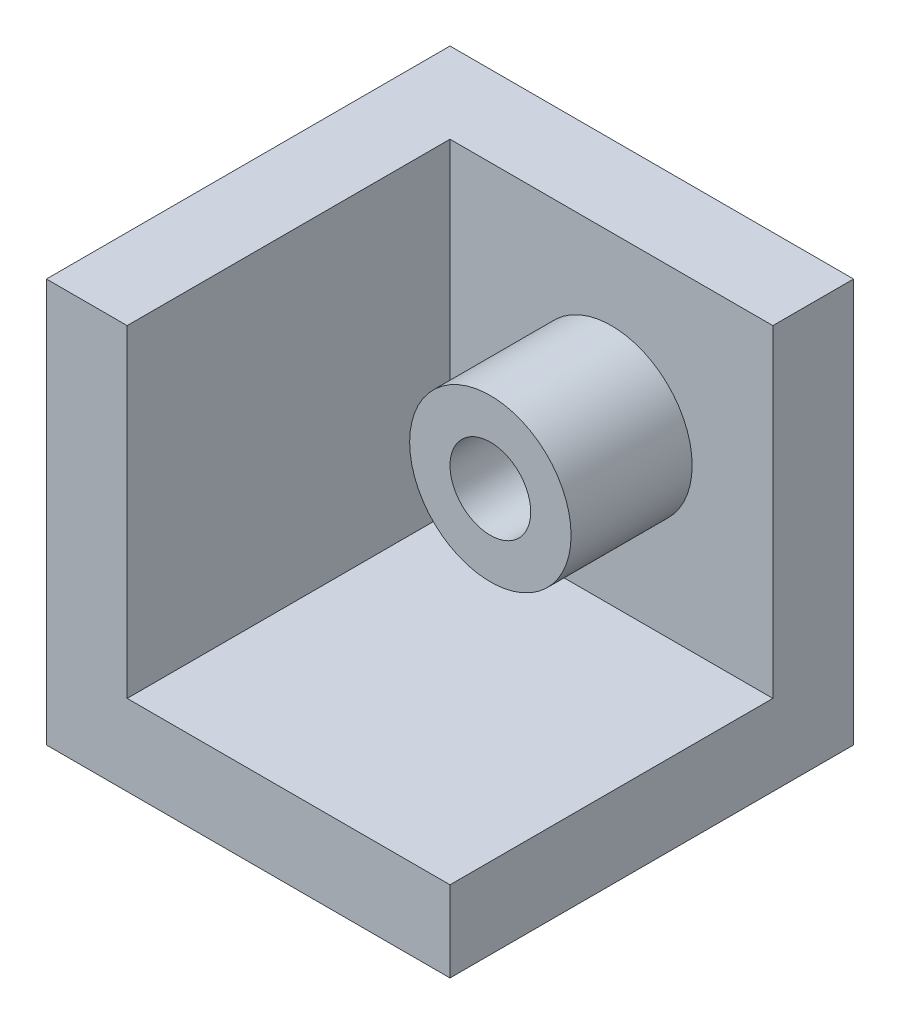
ISO-10303-21;
HEADER;
FILE_DESCRIPTION(('STEP AP214'),'2;1');
FILE_NAME('part.step','',(''),(''),'','','');
FILE_SCHEMA(('AUTOMOTIVE_DESIGN { 1 0 10303 214 1 1 1 1 }'));
ENDSEC;
DATA;
#1=APPLICATION_CONTEXT('core data for automotive mechanical design processes');
#2=APPLICATION_PROTOCOL_DEFINITION('international standard','automotive_design',2000,#1);
#3=PRODUCT_CONTEXT('',#1,'mechanical');
#4=PRODUCT('Part','Part','',(#3));
#5=PRODUCT_RELATED_PRODUCT_CATEGORY('part','',(#4));
#6=PRODUCT_DEFINITION_FORMATION('','',#4);
#7=PRODUCT_DEFINITION_CONTEXT('part definition',#1,'design');
#8=PRODUCT_DEFINITION('design','',#6,#7);
#9=PRODUCT_DEFINITION_SHAPE('','',#8);
#10=(LENGTH_UNIT() NAMED_UNIT(*) SI_UNIT(.MILLI.,.METRE.));
#11=(NAMED_UNIT(*) PLANE_ANGLE_UNIT() SI_UNIT($,.RADIAN.));
#12=(NAMED_UNIT(*) SI_UNIT($,.STERADIAN.) SOLID_ANGLE_UNIT());
#13=UNCERTAINTY_MEASURE_WITH_UNIT(LENGTH_MEASURE(1.E-05),#10,'distance_accuracy_value','');
#14=(GEOMETRIC_REPRESENTATION_CONTEXT(3) GLOBAL_UNCERTAINTY_ASSIGNED_CONTEXT((#13)) GLOBAL_UNIT_ASSIGNED_CONTEXT((#10,
#11,#12)) REPRESENTATION_CONTEXT('',''));
#15=CARTESIAN_POINT('',(0.,0.,0.));
#16=DIRECTION('',(0.,0.,1.));
#17=DIRECTION('',(1.,0.,0.));
#18=AXIS2_PLACEMENT_3D('',#15,#16,#17);
#19=CARTESIAN_POINT('',(100.,20.,20.));
#20=DIRECTION('',(0.,0.,-1.));
#21=DIRECTION('',(-1.,0.,0.));
#22=AXIS2_PLACEMENT_3D('',#19,#20,#21);
#23=PLANE('',#22);
#24=DIRECTION('',(-1.,0.,0.));
#25=VECTOR('',#24,1.);
#26=CARTESIAN_POINT('',(100.,100.,20.));
#27=LINE('',#26,#25);
#28=CARTESIAN_POINT('',(100.,100.,20.));
#29=VERTEX_POINT('',#28);
#30=CARTESIAN_POINT('',(20.,100.,20.));
#31=VERTEX_POINT('',#30);
#32=EDGE_CURVE('E190',#29,#31,#27,.T.);
#33=ORIENTED_EDGE('',*,*,#32,.T.);
#34=DIRECTION('',(0.,1.,0.));
#35=VECTOR('',#34,1.);
#36=CARTESIAN_POINT('',(20.,20.,20.));
#37=LINE('',#36,#35);
#38=CARTESIAN_POINT('',(20.,20.,20.));
#39=VERTEX_POINT('',#38);
#40=EDGE_CURVE('E117',#39,#31,#37,.T.);
#41=ORIENTED_EDGE('',*,*,#40,.F.);
#42=DIRECTION('',(-1.,0.,0.));
#43=VECTOR('',#42,1.);
#44=CARTESIAN_POINT('',(100.,20.,20.));
#45=LINE('',#44,#43);
#46=CARTESIAN_POINT('',(100.,20.,20.));
#47=VERTEX_POINT('',#46);
#48=EDGE_CURVE('E110',#47,#39,#45,.T.);
#49=ORIENTED_EDGE('',*,*,#48,.F.);
#50=DIRECTION('',(0.,1.,0.));
#51=VECTOR('',#50,1.);
#52=CARTESIAN_POINT('',(100.,20.,20.));
#53=LINE('',#52,#51);
#54=EDGE_CURVE('E115',#47,#29,#53,.T.);
#55=ORIENTED_EDGE('',*,*,#54,.T.);
#56=EDGE_LOOP('',(#33,#41,#49,#55));
#57=FACE_BOUND('',#56,.T.);
#58=CARTESIAN_POINT('',(60.,60.,20.));
#59=DIRECTION('',(0.,0.,-1.));
#60=DIRECTION('',(-1.,0.,0.));
#61=AXIS2_PLACEMENT_3D('',#58,#59,#60);
#62=CIRCLE('',#61,20.);
#63=CARTESIAN_POINT('',(40.,60.,20.));
#64=VERTEX_POINT('',#63);
#65=EDGE_CURVE('E11',#64,#64,#62,.F.);
#66=ORIENTED_EDGE('',*,*,#65,.F.);
#67=EDGE_LOOP('',(#66));
#68=FACE_BOUND('',#67,.T.);
#69=ADVANCED_FACE('F41',(#57,#68),#23,.F.);
#70=CARTESIAN_POINT('',(0.,0.,100.));
#71=DIRECTION('',(1.,0.,0.));
#72=DIRECTION('',(0.,0.,-1.));
#73=AXIS2_PLACEMENT_3D('',#70,#71,#72);
#74=PLANE('',#73);
#75=DIRECTION('',(0.,-1.,0.));
#76=VECTOR('',#75,1.);
#77=CARTESIAN_POINT('',(0.,0.,0.));
#78=LINE('',#77,#76);
#79=CARTESIAN_POINT('',(0.,100.,0.));
#80=VERTEX_POINT('',#79);
#81=CARTESIAN_POINT('',(0.,0.,0.));
#82=VERTEX_POINT('',#81);
#83=EDGE_CURVE('E156',#80,#82,#78,.T.);
#84=ORIENTED_EDGE('',*,*,#83,.T.);
#85=DIRECTION('',(0.,0.,-1.));
#86=VECTOR('',#85,1.);
#87=CARTESIAN_POINT('',(0.,0.,100.));
#88=LINE('',#87,#86);
#89=CARTESIAN_POINT('',(0.,0.,100.));
#90=VERTEX_POINT('',#89);
#91=EDGE_CURVE('E50',#90,#82,#88,.T.);
#92=ORIENTED_EDGE('',*,*,#91,.F.);
#93=DIRECTION('',(0.,-1.,0.));
#94=VECTOR('',#93,1.);
#95=CARTESIAN_POINT('',(0.,0.,100.));
#96=LINE('',#95,#94);
#97=CARTESIAN_POINT('',(0.,100.,100.));
#98=VERTEX_POINT('',#97);
#99=EDGE_CURVE('E145',#98,#90,#96,.T.);
#100=ORIENTED_EDGE('',*,*,#99,.F.);
#101=DIRECTION('',(0.,0.,-1.));
#102=VECTOR('',#101,1.);
#103=CARTESIAN_POINT('',(0.,100.,100.));
#104=LINE('',#103,#102);
#105=EDGE_CURVE('E155',#98,#80,#104,.T.);
#106=ORIENTED_EDGE('',*,*,#105,.T.);
#107=EDGE_LOOP('',(#84,#92,#100,#106));
#108=FACE_BOUND('',#107,.T.);
#109=ADVANCED_FACE('F43',(#108),#74,.F.);
#110=CARTESIAN_POINT('',(0.,0.,100.));
#111=DIRECTION('',(0.,1.,0.));
#112=DIRECTION('',(0.,0.,1.));
#113=AXIS2_PLACEMENT_3D('',#110,#111,#112);
#114=PLANE('',#113);
#115=DIRECTION('',(1.,0.,0.));
#116=VECTOR('',#115,1.);
#117=CARTESIAN_POINT('',(0.,0.,0.));
#118=LINE('',#117,#116);
#119=CARTESIAN_POINT('',(100.,0.,0.));
#120=VERTEX_POINT('',#119);
#121=EDGE_CURVE('E160',#82,#120,#118,.T.);
#122=ORIENTED_EDGE('',*,*,#121,.T.);
#123=DIRECTION('',(0.,0.,-1.));
#124=VECTOR('',#123,1.);
#125=CARTESIAN_POINT('',(100.,0.,100.));
#126=LINE('',#125,#124);
#127=CARTESIAN_POINT('',(100.,0.,100.));
#128=VERTEX_POINT('',#127);
#129=EDGE_CURVE('E172',#128,#120,#126,.T.);
#130=ORIENTED_EDGE('',*,*,#129,.F.);
#131=DIRECTION('',(1.,0.,0.));
#132=VECTOR('',#131,1.);
#133=CARTESIAN_POINT('',(0.,0.,100.));
#134=LINE('',#133,#132);
#135=EDGE_CURVE('E92',#90,#128,#134,.T.);
#136=ORIENTED_EDGE('',*,*,#135,.F.);
#137=ORIENTED_EDGE('',*,*,#91,.T.);
#138=EDGE_LOOP('',(#122,#130,#136,#137));
#139=FACE_BOUND('',#138,.T.);
#140=ADVANCED_FACE('F178',(#139),#114,.F.);
#141=CARTESIAN_POINT('',(100.,0.,100.));
#142=DIRECTION('',(-1.,0.,0.));
#143=DIRECTION('',(0.,0.,1.));
#144=AXIS2_PLACEMENT_3D('',#141,#142,#143);
#145=PLANE('',#144);
#146=DIRECTION('',(0.,0.,-1.));
#147=VECTOR('',#146,1.);
#148=CARTESIAN_POINT('',(100.,100.,100.));
#149=LINE('',#148,#147);
#150=CARTESIAN_POINT('',(100.,100.,0.));
#151=VERTEX_POINT('',#150);
#152=EDGE_CURVE('E134',#29,#151,#149,.T.);
#153=ORIENTED_EDGE('',*,*,#152,.F.);
#154=ORIENTED_EDGE('',*,*,#54,.F.);
#155=DIRECTION('',(0.,0.,-1.));
#156=VECTOR('',#155,1.);
#157=CARTESIAN_POINT('',(100.,20.,100.));
#158=LINE('',#157,#156);
#159=CARTESIAN_POINT('',(100.,20.,100.));
#160=VERTEX_POINT('',#159);
#161=EDGE_CURVE('E119',#160,#47,#158,.T.);
#162=ORIENTED_EDGE('',*,*,#161,.F.);
#163=DIRECTION('',(0.,1.,0.));
#164=VECTOR('',#163,1.);
#165=CARTESIAN_POINT('',(100.,0.,100.));
#166=LINE('',#165,#164);
#167=EDGE_CURVE('E150',#128,#160,#166,.T.);
#168=ORIENTED_EDGE('',*,*,#167,.F.);
#169=ORIENTED_EDGE('',*,*,#129,.T.);
#170=DIRECTION('',(0.,1.,0.));
#171=VECTOR('',#170,1.);
#172=CARTESIAN_POINT('',(100.,0.,0.));
#173=LINE('',#172,#171);
#174=EDGE_CURVE('E163',#120,#151,#173,.T.);
#175=ORIENTED_EDGE('',*,*,#174,.T.);
#176=EDGE_LOOP('',(#153,#154,#162,#168,#169,#175));
#177=FACE_BOUND('',#176,.T.);
#178=ADVANCED_FACE('F132',(#177),#145,.F.);
#179=CARTESIAN_POINT('',(0.,100.,100.));
#180=DIRECTION('',(0.,-1.,0.));
#181=DIRECTION('',(0.,0.,-1.));
#182=AXIS2_PLACEMENT_3D('',#179,#180,#181);
#183=PLANE('',#182);
#184=DIRECTION('',(-1.,0.,0.));
#185=VECTOR('',#184,1.);
#186=CARTESIAN_POINT('',(0.,100.,100.));
#187=LINE('',#186,#185);
#188=CARTESIAN_POINT('',(20.,100.,100.));
#189=VERTEX_POINT('',#188);
#190=EDGE_CURVE('E66',#189,#98,#187,.T.);
#191=ORIENTED_EDGE('',*,*,#190,.F.);
#192=DIRECTION('',(0.,0.,1.));
#193=VECTOR('',#192,1.);
#194=CARTESIAN_POINT('',(20.,100.,20.));
#195=LINE('',#194,#193);
#196=EDGE_CURVE('E129',#31,#189,#195,.T.);
#197=ORIENTED_EDGE('',*,*,#196,.F.);
#198=ORIENTED_EDGE('',*,*,#32,.F.);
#199=ORIENTED_EDGE('',*,*,#152,.T.);
#200=DIRECTION('',(-1.,0.,0.));
#201=VECTOR('',#200,1.);
#202=CARTESIAN_POINT('',(0.,100.,0.));
#203=LINE('',#202,#201);
#204=EDGE_CURVE('E86',#151,#80,#203,.T.);
#205=ORIENTED_EDGE('',*,*,#204,.T.);
#206=ORIENTED_EDGE('',*,*,#105,.F.);
#207=EDGE_LOOP('',(#191,#197,#198,#199,#205,#206));
#208=FACE_BOUND('',#207,.T.);
#209=ADVANCED_FACE('F189',(#208),#183,.F.);
#210=CARTESIAN_POINT('',(0.,0.,100.));
#211=DIRECTION('',(0.,0.,-1.));
#212=DIRECTION('',(-1.,0.,0.));
#213=AXIS2_PLACEMENT_3D('',#210,#211,#212);
#214=PLANE('',#213);
#215=DIRECTION('',(1.,0.,0.));
#216=VECTOR('',#215,1.);
#217=CARTESIAN_POINT('',(20.,20.,100.));
#218=LINE('',#217,#216);
#219=CARTESIAN_POINT('',(20.,20.,100.));
#220=VERTEX_POINT('',#219);
#221=EDGE_CURVE('E124',#220,#160,#218,.T.);
#222=ORIENTED_EDGE('',*,*,#221,.F.);
#223=DIRECTION('',(0.,1.,0.));
#224=VECTOR('',#223,1.);
#225=CARTESIAN_POINT('',(20.,20.,100.));
#226=LINE('',#225,#224);
#227=EDGE_CURVE('E140',#220,#189,#226,.T.);
#228=ORIENTED_EDGE('',*,*,#227,.T.);
#229=ORIENTED_EDGE('',*,*,#190,.T.);
#230=ORIENTED_EDGE('',*,*,#99,.T.);
#231=ORIENTED_EDGE('',*,*,#135,.T.);
#232=ORIENTED_EDGE('',*,*,#167,.T.);
#233=EDGE_LOOP('',(#222,#228,#229,#230,#231,#232));
#234=FACE_BOUND('',#233,.T.);
#235=ADVANCED_FACE('F185',(#234),#214,.F.);
#236=CARTESIAN_POINT('',(0.,0.,0.));
#237=DIRECTION('',(0.,0.,-1.));
#238=DIRECTION('',(-1.,0.,0.));
#239=AXIS2_PLACEMENT_3D('',#236,#237,#238);
#240=PLANE('',#239);
#241=CARTESIAN_POINT('',(60.,60.,0.));
#242=DIRECTION('',(0.,0.,1.));
#243=DIRECTION('',(1.,0.,0.));
#244=AXIS2_PLACEMENT_3D('',#241,#242,#243);
#245=CIRCLE('',#244,9.99999999999999);
#246=CARTESIAN_POINT('',(70.,60.,0.));
#247=VERTEX_POINT('',#246);
#248=EDGE_CURVE('E195',#247,#247,#245,.T.);
#249=ORIENTED_EDGE('',*,*,#248,.T.);
#250=EDGE_LOOP('',(#249));
#251=FACE_BOUND('',#250,.T.);
#252=ORIENTED_EDGE('',*,*,#83,.F.);
#253=ORIENTED_EDGE('',*,*,#204,.F.);
#254=ORIENTED_EDGE('',*,*,#174,.F.);
#255=ORIENTED_EDGE('',*,*,#121,.F.);
#256=EDGE_LOOP('',(#252,#253,#254,#255));
#257=FACE_BOUND('',#256,.T.);
#258=ADVANCED_FACE('F183',(#251,#257),#240,.T.);
#259=CARTESIAN_POINT('',(20.,20.,20.));
#260=DIRECTION('',(-1.,0.,0.));
#261=DIRECTION('',(0.,0.,1.));
#262=AXIS2_PLACEMENT_3D('',#259,#260,#261);
#263=PLANE('',#262);
#264=ORIENTED_EDGE('',*,*,#196,.T.);
#265=ORIENTED_EDGE('',*,*,#227,.F.);
#266=DIRECTION('',(0.,0.,1.));
#267=VECTOR('',#266,1.);
#268=CARTESIAN_POINT('',(20.,20.,20.));
#269=LINE('',#268,#267);
#270=EDGE_CURVE('E57',#39,#220,#269,.T.);
#271=ORIENTED_EDGE('',*,*,#270,.F.);
#272=ORIENTED_EDGE('',*,*,#40,.T.);
#273=EDGE_LOOP('',(#264,#265,#271,#272));
#274=FACE_BOUND('',#273,.T.);
#275=ADVANCED_FACE('F235',(#274),#263,.F.);
#276=CARTESIAN_POINT('',(0.,20.,0.));
#277=DIRECTION('',(0.,1.,0.));
#278=DIRECTION('',(0.,0.,1.));
#279=AXIS2_PLACEMENT_3D('',#276,#277,#278);
#280=PLANE('',#279);
#281=ORIENTED_EDGE('',*,*,#161,.T.);
#282=ORIENTED_EDGE('',*,*,#48,.T.);
#283=ORIENTED_EDGE('',*,*,#270,.T.);
#284=ORIENTED_EDGE('',*,*,#221,.T.);
#285=EDGE_LOOP('',(#281,#282,#283,#284));
#286=FACE_BOUND('',#285,.T.);
#287=ADVANCED_FACE('F122',(#286),#280,.T.);
#288=CARTESIAN_POINT('',(60.,60.,0.));
#289=DIRECTION('',(0.,0.,1.));
#290=DIRECTION('',(1.,0.,0.));
#291=AXIS2_PLACEMENT_3D('',#288,#289,#290);
#292=CYLINDRICAL_SURFACE('',#291,9.99999999999999);
#293=ORIENTED_EDGE('',*,*,#248,.F.);
#294=EDGE_LOOP('',(#293));
#295=FACE_BOUND('',#294,.T.);
#296=CARTESIAN_POINT('',(60.,60.,50.));
#297=DIRECTION('',(0.,0.,1.));
#298=DIRECTION('',(1.,0.,0.));
#299=AXIS2_PLACEMENT_3D('',#296,#297,#298);
#300=CIRCLE('',#299,9.99999999999999);
#301=CARTESIAN_POINT('',(70.,60.,50.));
#302=VERTEX_POINT('',#301);
#303=EDGE_CURVE('E207',#302,#302,#300,.T.);
#304=ORIENTED_EDGE('',*,*,#303,.T.);
#305=EDGE_LOOP('',(#304));
#306=FACE_BOUND('',#305,.T.);
#307=ADVANCED_FACE('F213',(#295,#306),#292,.F.);
#308=CARTESIAN_POINT('',(60.,60.,50.));
#309=DIRECTION('',(0.,0.,1.));
#310=DIRECTION('',(1.,0.,0.));
#311=AXIS2_PLACEMENT_3D('',#308,#309,#310);
#312=PLANE('',#311);
#313=CARTESIAN_POINT('',(60.,60.,50.));
#314=DIRECTION('',(0.,0.,1.));
#315=DIRECTION('',(1.,0.,0.));
#316=AXIS2_PLACEMENT_3D('',#313,#314,#315);
#317=CIRCLE('',#316,20.);
#318=CARTESIAN_POINT('',(80.,60.,50.));
#319=VERTEX_POINT('',#318);
#320=EDGE_CURVE('E203',#319,#319,#317,.T.);
#321=ORIENTED_EDGE('',*,*,#320,.T.);
#322=EDGE_LOOP('',(#321));
#323=FACE_BOUND('',#322,.T.);
#324=ORIENTED_EDGE('',*,*,#303,.F.);
#325=EDGE_LOOP('',(#324));
#326=FACE_BOUND('',#325,.T.);
#327=ADVANCED_FACE('F215',(#323,#326),#312,.T.);
#328=CARTESIAN_POINT('',(60.,60.,50.));
#329=DIRECTION('',(0.,0.,-1.));
#330=DIRECTION('',(-1.,0.,0.));
#331=AXIS2_PLACEMENT_3D('',#328,#329,#330);
#332=CYLINDRICAL_SURFACE('',#331,20.);
#333=ORIENTED_EDGE('',*,*,#320,.F.);
#334=EDGE_LOOP('',(#333));
#335=FACE_BOUND('',#334,.T.);
#336=ORIENTED_EDGE('',*,*,#65,.T.);
#337=EDGE_LOOP('',(#336));
#338=FACE_BOUND('',#337,.T.);
#339=ADVANCED_FACE('F217',(#335,#338),#332,.T.);
#340=CLOSED_SHELL('',(#69,#109,#140,#178,#209,#235,#258,#275,#287,#307,#327,#339));
#341=MANIFOLD_SOLID_BREP('B2',#340);
#342=ADVANCED_BREP_SHAPE_REPRESENTATION('',(#18,#341),#14);
#343=SHAPE_DEFINITION_REPRESENTATION(#9,#342);
ENDSEC;
END-ISO-10303-21;
